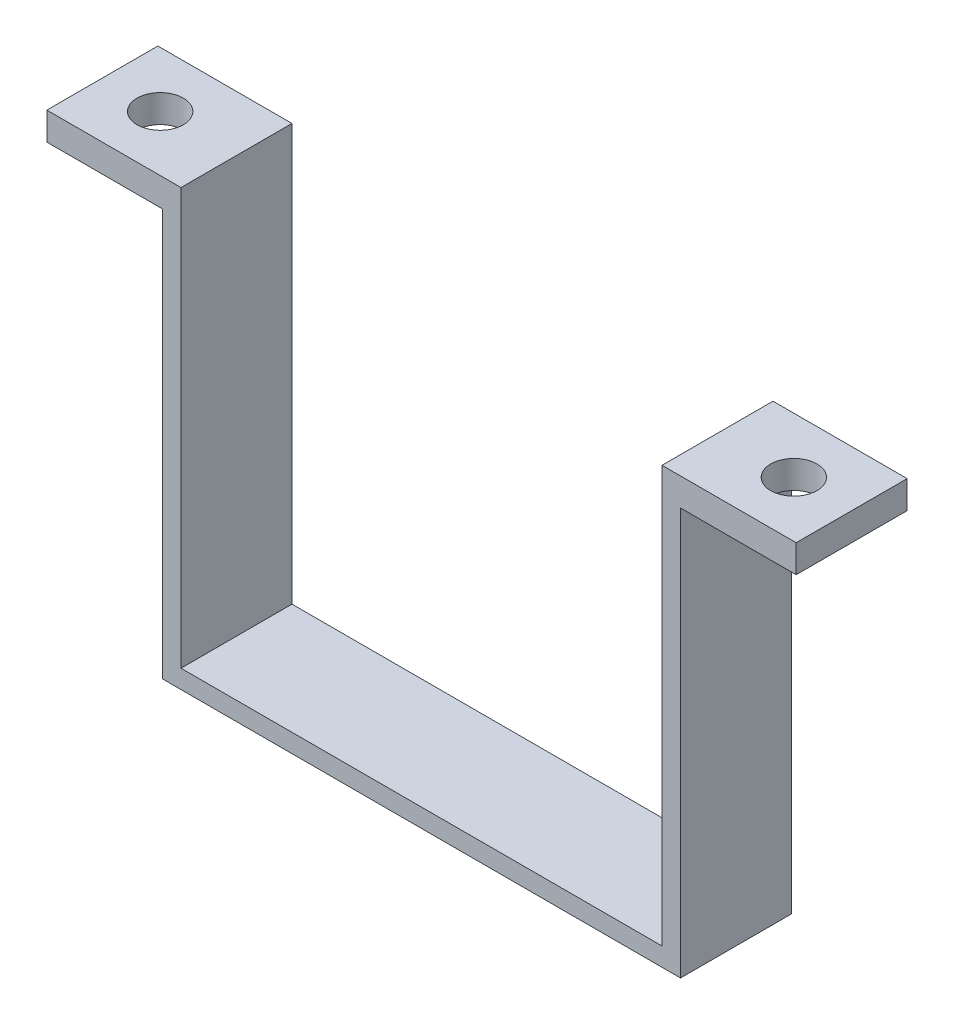
ISO-10303-21;
HEADER;
FILE_DESCRIPTION(('STEP AP214'),'2;1');
FILE_NAME('part.step','',(''),(''),'','','');
FILE_SCHEMA(('AUTOMOTIVE_DESIGN { 1 0 10303 214 1 1 1 1 }'));
ENDSEC;
DATA;
#1=APPLICATION_CONTEXT('core data for automotive mechanical design processes');
#2=APPLICATION_PROTOCOL_DEFINITION('international standard','automotive_design',2000,#1);
#3=PRODUCT_CONTEXT('',#1,'mechanical');
#4=PRODUCT('Part','Part','',(#3));
#5=PRODUCT_RELATED_PRODUCT_CATEGORY('part','',(#4));
#6=PRODUCT_DEFINITION_FORMATION('','',#4);
#7=PRODUCT_DEFINITION_CONTEXT('part definition',#1,'design');
#8=PRODUCT_DEFINITION('design','',#6,#7);
#9=PRODUCT_DEFINITION_SHAPE('','',#8);
#10=(LENGTH_UNIT() NAMED_UNIT(*) SI_UNIT(.MILLI.,.METRE.));
#11=(NAMED_UNIT(*) PLANE_ANGLE_UNIT() SI_UNIT($,.RADIAN.));
#12=(NAMED_UNIT(*) SI_UNIT($,.STERADIAN.) SOLID_ANGLE_UNIT());
#13=UNCERTAINTY_MEASURE_WITH_UNIT(LENGTH_MEASURE(1.E-05),#10,'distance_accuracy_value','');
#14=(GEOMETRIC_REPRESENTATION_CONTEXT(3) GLOBAL_UNCERTAINTY_ASSIGNED_CONTEXT((#13)) GLOBAL_UNIT_ASSIGNED_CONTEXT((#10,
#11,#12)) REPRESENTATION_CONTEXT('',''));
#15=CARTESIAN_POINT('',(0.,0.,0.));
#16=DIRECTION('',(0.,0.,1.));
#17=DIRECTION('',(1.,0.,0.));
#18=AXIS2_PLACEMENT_3D('',#15,#16,#17);
#19=CARTESIAN_POINT('',(0.,-42.,12.));
#20=DIRECTION('',(0.,-1.,0.));
#21=DIRECTION('',(1.,0.,0.));
#22=AXIS2_PLACEMENT_3D('',#19,#20,#21);
#23=PLANE('',#22);
#24=DIRECTION('',(-1.,0.,0.));
#25=VECTOR('',#24,1.);
#26=CARTESIAN_POINT('',(0.,-42.,0.));
#27=LINE('',#26,#25);
#28=CARTESIAN_POINT('',(0.,-42.,0.));
#29=VERTEX_POINT('',#28);
#30=CARTESIAN_POINT('',(-52.,-42.,0.));
#31=VERTEX_POINT('',#30);
#32=EDGE_CURVE('E144',#29,#31,#27,.T.);
#33=ORIENTED_EDGE('',*,*,#32,.T.);
#34=DIRECTION('',(0.,0.,-1.));
#35=VECTOR('',#34,1.);
#36=CARTESIAN_POINT('',(-52.,-42.,12.));
#37=LINE('',#36,#35);
#38=CARTESIAN_POINT('',(-52.,-42.,12.));
#39=VERTEX_POINT('',#38);
#40=EDGE_CURVE('E45',#39,#31,#37,.T.);
#41=ORIENTED_EDGE('',*,*,#40,.F.);
#42=DIRECTION('',(-1.,0.,0.));
#43=VECTOR('',#42,1.);
#44=CARTESIAN_POINT('',(0.,-42.,12.));
#45=LINE('',#44,#43);
#46=CARTESIAN_POINT('',(0.,-42.,12.));
#47=VERTEX_POINT('',#46);
#48=EDGE_CURVE('E99',#47,#39,#45,.T.);
#49=ORIENTED_EDGE('',*,*,#48,.F.);
#50=DIRECTION('',(0.,0.,-1.));
#51=VECTOR('',#50,1.);
#52=CARTESIAN_POINT('',(0.,-42.,12.));
#53=LINE('',#52,#51);
#54=EDGE_CURVE('E11',#47,#29,#53,.T.);
#55=ORIENTED_EDGE('',*,*,#54,.T.);
#56=EDGE_LOOP('',(#33,#41,#49,#55));
#57=FACE_BOUND('',#56,.T.);
#58=ADVANCED_FACE('F36',(#57),#23,.F.);
#59=CARTESIAN_POINT('',(-52.,-42.,12.));
#60=DIRECTION('',(-1.,0.,0.));
#61=DIRECTION('',(0.,0.,1.));
#62=AXIS2_PLACEMENT_3D('',#59,#60,#61);
#63=PLANE('',#62);
#64=DIRECTION('',(0.,1.,0.));
#65=VECTOR('',#64,1.);
#66=CARTESIAN_POINT('',(-52.,-42.,0.));
#67=LINE('',#66,#65);
#68=CARTESIAN_POINT('',(-52.,2.99999999999999,0.));
#69=VERTEX_POINT('',#68);
#70=EDGE_CURVE('E146',#31,#69,#67,.T.);
#71=ORIENTED_EDGE('',*,*,#70,.T.);
#72=DIRECTION('',(0.,0.,-1.));
#73=VECTOR('',#72,1.);
#74=CARTESIAN_POINT('',(-52.,2.99999999999999,12.));
#75=LINE('',#74,#73);
#76=CARTESIAN_POINT('',(-52.,2.99999999999999,12.));
#77=VERTEX_POINT('',#76);
#78=EDGE_CURVE('E170',#77,#69,#75,.T.);
#79=ORIENTED_EDGE('',*,*,#78,.F.);
#80=DIRECTION('',(0.,1.,0.));
#81=VECTOR('',#80,1.);
#82=CARTESIAN_POINT('',(-52.,-42.,12.));
#83=LINE('',#82,#81);
#84=EDGE_CURVE('E179',#39,#77,#83,.T.);
#85=ORIENTED_EDGE('',*,*,#84,.F.);
#86=ORIENTED_EDGE('',*,*,#40,.T.);
#87=EDGE_LOOP('',(#71,#79,#85,#86));
#88=FACE_BOUND('',#87,.T.);
#89=ADVANCED_FACE('F177',(#88),#63,.F.);
#90=CARTESIAN_POINT('',(-52.,2.99999999999999,12.));
#91=DIRECTION('',(0.,-1.,0.));
#92=DIRECTION('',(1.,0.,0.));
#93=AXIS2_PLACEMENT_3D('',#90,#91,#92);
#94=PLANE('',#93);
#95=CARTESIAN_POINT('',(-60.25,2.99999999999999,6.));
#96=DIRECTION('',(0.,-1.,0.));
#97=DIRECTION('',(1.,0.,0.));
#98=AXIS2_PLACEMENT_3D('',#95,#96,#97);
#99=CIRCLE('',#98,2.5);
#100=CARTESIAN_POINT('',(-57.75,2.99999999999999,6.));
#101=VERTEX_POINT('',#100);
#102=EDGE_CURVE('E254',#101,#101,#99,.T.);
#103=ORIENTED_EDGE('',*,*,#102,.T.);
#104=EDGE_LOOP('',(#103));
#105=FACE_BOUND('',#104,.T.);
#106=DIRECTION('',(-1.,0.,0.));
#107=VECTOR('',#106,1.);
#108=CARTESIAN_POINT('',(-52.,2.99999999999999,0.));
#109=LINE('',#108,#107);
#110=CARTESIAN_POINT('',(-66.5,2.99999999999999,0.));
#111=VERTEX_POINT('',#110);
#112=EDGE_CURVE('E149',#69,#111,#109,.T.);
#113=ORIENTED_EDGE('',*,*,#112,.T.);
#114=DIRECTION('',(0.,0.,-1.));
#115=VECTOR('',#114,1.);
#116=CARTESIAN_POINT('',(-66.5,2.99999999999999,0.));
#117=LINE('',#116,#115);
#118=CARTESIAN_POINT('',(-66.5,2.99999999999999,12.));
#119=VERTEX_POINT('',#118);
#120=EDGE_CURVE('E196',#119,#111,#117,.T.);
#121=ORIENTED_EDGE('',*,*,#120,.F.);
#122=DIRECTION('',(-1.,0.,0.));
#123=VECTOR('',#122,1.);
#124=CARTESIAN_POINT('',(-52.,2.99999999999999,12.));
#125=LINE('',#124,#123);
#126=EDGE_CURVE('E225',#77,#119,#125,.T.);
#127=ORIENTED_EDGE('',*,*,#126,.F.);
#128=ORIENTED_EDGE('',*,*,#78,.T.);
#129=EDGE_LOOP('',(#113,#121,#127,#128));
#130=FACE_BOUND('',#129,.T.);
#131=ADVANCED_FACE('F193',(#105,#130),#94,.F.);
#132=CARTESIAN_POINT('',(-64.,0.,12.));
#133=DIRECTION('',(0.,1.,0.));
#134=DIRECTION('',(0.,0.,1.));
#135=AXIS2_PLACEMENT_3D('',#132,#133,#134);
#136=PLANE('',#135);
#137=CARTESIAN_POINT('',(-60.25,0.,6.));
#138=DIRECTION('',(0.,-1.,0.));
#139=DIRECTION('',(0.,0.,-1.));
#140=AXIS2_PLACEMENT_3D('',#137,#138,#139);
#141=CIRCLE('',#140,2.5);
#142=CARTESIAN_POINT('',(-60.25,0.,3.5));
#143=VERTEX_POINT('',#142);
#144=EDGE_CURVE('E259',#143,#143,#141,.T.);
#145=ORIENTED_EDGE('',*,*,#144,.F.);
#146=EDGE_LOOP('',(#145));
#147=FACE_BOUND('',#146,.T.);
#148=DIRECTION('',(1.,0.,0.));
#149=VECTOR('',#148,1.);
#150=CARTESIAN_POINT('',(-64.,0.,0.));
#151=LINE('',#150,#149);
#152=CARTESIAN_POINT('',(-66.5,0.,0.));
#153=VERTEX_POINT('',#152);
#154=CARTESIAN_POINT('',(-54.,0.,0.));
#155=VERTEX_POINT('',#154);
#156=EDGE_CURVE('E152',#153,#155,#151,.T.);
#157=ORIENTED_EDGE('',*,*,#156,.T.);
#158=DIRECTION('',(0.,0.,-1.));
#159=VECTOR('',#158,1.);
#160=CARTESIAN_POINT('',(-54.,0.,12.));
#161=LINE('',#160,#159);
#162=CARTESIAN_POINT('',(-54.,0.,12.));
#163=VERTEX_POINT('',#162);
#164=EDGE_CURVE('E167',#163,#155,#161,.T.);
#165=ORIENTED_EDGE('',*,*,#164,.F.);
#166=DIRECTION('',(1.,0.,0.));
#167=VECTOR('',#166,1.);
#168=CARTESIAN_POINT('',(-64.,0.,12.));
#169=LINE('',#168,#167);
#170=CARTESIAN_POINT('',(-66.5,0.,12.));
#171=VERTEX_POINT('',#170);
#172=EDGE_CURVE('E228',#171,#163,#169,.T.);
#173=ORIENTED_EDGE('',*,*,#172,.F.);
#174=DIRECTION('',(0.,0.,1.));
#175=VECTOR('',#174,1.);
#176=CARTESIAN_POINT('',(-66.5,0.,0.));
#177=LINE('',#176,#175);
#178=EDGE_CURVE('E211',#153,#171,#177,.T.);
#179=ORIENTED_EDGE('',*,*,#178,.F.);
#180=EDGE_LOOP('',(#157,#165,#173,#179));
#181=FACE_BOUND('',#180,.T.);
#182=ADVANCED_FACE('F234',(#147,#181),#136,.F.);
#183=CARTESIAN_POINT('',(-54.,-44.,12.));
#184=DIRECTION('',(1.,0.,0.));
#185=DIRECTION('',(0.,0.,-1.));
#186=AXIS2_PLACEMENT_3D('',#183,#184,#185);
#187=PLANE('',#186);
#188=DIRECTION('',(0.,-1.,0.));
#189=VECTOR('',#188,1.);
#190=CARTESIAN_POINT('',(-54.,-44.,0.));
#191=LINE('',#190,#189);
#192=CARTESIAN_POINT('',(-54.,-44.,0.));
#193=VERTEX_POINT('',#192);
#194=EDGE_CURVE('E154',#155,#193,#191,.T.);
#195=ORIENTED_EDGE('',*,*,#194,.T.);
#196=DIRECTION('',(0.,0.,-1.));
#197=VECTOR('',#196,1.);
#198=CARTESIAN_POINT('',(-54.,-44.,12.));
#199=LINE('',#198,#197);
#200=CARTESIAN_POINT('',(-54.,-44.,12.));
#201=VERTEX_POINT('',#200);
#202=EDGE_CURVE('E131',#201,#193,#199,.T.);
#203=ORIENTED_EDGE('',*,*,#202,.F.);
#204=DIRECTION('',(0.,-1.,0.));
#205=VECTOR('',#204,1.);
#206=CARTESIAN_POINT('',(-54.,-44.,12.));
#207=LINE('',#206,#205);
#208=EDGE_CURVE('E122',#163,#201,#207,.T.);
#209=ORIENTED_EDGE('',*,*,#208,.F.);
#210=ORIENTED_EDGE('',*,*,#164,.T.);
#211=EDGE_LOOP('',(#195,#203,#209,#210));
#212=FACE_BOUND('',#211,.T.);
#213=ADVANCED_FACE('F237',(#212),#187,.F.);
#214=CARTESIAN_POINT('',(2.00000000000001,-44.,12.));
#215=DIRECTION('',(0.,1.,0.));
#216=DIRECTION('',(0.,0.,1.));
#217=AXIS2_PLACEMENT_3D('',#214,#215,#216);
#218=PLANE('',#217);
#219=DIRECTION('',(1.,0.,0.));
#220=VECTOR('',#219,1.);
#221=CARTESIAN_POINT('',(2.00000000000001,-44.,0.));
#222=LINE('',#221,#220);
#223=CARTESIAN_POINT('',(2.00000000000001,-44.,0.));
#224=VERTEX_POINT('',#223);
#225=EDGE_CURVE('E130',#193,#224,#222,.T.);
#226=ORIENTED_EDGE('',*,*,#225,.T.);
#227=DIRECTION('',(0.,0.,-1.));
#228=VECTOR('',#227,1.);
#229=CARTESIAN_POINT('',(2.00000000000001,-44.,12.));
#230=LINE('',#229,#228);
#231=CARTESIAN_POINT('',(2.00000000000001,-44.,12.));
#232=VERTEX_POINT('',#231);
#233=EDGE_CURVE('E127',#232,#224,#230,.T.);
#234=ORIENTED_EDGE('',*,*,#233,.F.);
#235=DIRECTION('',(1.,0.,0.));
#236=VECTOR('',#235,1.);
#237=CARTESIAN_POINT('',(2.00000000000001,-44.,12.));
#238=LINE('',#237,#236);
#239=EDGE_CURVE('E115',#201,#232,#238,.T.);
#240=ORIENTED_EDGE('',*,*,#239,.F.);
#241=ORIENTED_EDGE('',*,*,#202,.T.);
#242=EDGE_LOOP('',(#226,#234,#240,#241));
#243=FACE_BOUND('',#242,.T.);
#244=ADVANCED_FACE('F128',(#243),#218,.F.);
#245=CARTESIAN_POINT('',(2.,0.,12.));
#246=DIRECTION('',(-1.,0.,0.));
#247=DIRECTION('',(0.,-1.,0.));
#248=AXIS2_PLACEMENT_3D('',#245,#246,#247);
#249=PLANE('',#248);
#250=DIRECTION('',(0.,1.,0.));
#251=VECTOR('',#250,1.);
#252=CARTESIAN_POINT('',(2.,0.,0.));
#253=LINE('',#252,#251);
#254=CARTESIAN_POINT('',(2.,0.,0.));
#255=VERTEX_POINT('',#254);
#256=EDGE_CURVE('E84',#224,#255,#253,.T.);
#257=ORIENTED_EDGE('',*,*,#256,.T.);
#258=DIRECTION('',(0.,0.,-1.));
#259=VECTOR('',#258,1.);
#260=CARTESIAN_POINT('',(2.,0.,12.));
#261=LINE('',#260,#259);
#262=CARTESIAN_POINT('',(2.,0.,12.));
#263=VERTEX_POINT('',#262);
#264=EDGE_CURVE('E132',#263,#255,#261,.T.);
#265=ORIENTED_EDGE('',*,*,#264,.F.);
#266=DIRECTION('',(0.,1.,0.));
#267=VECTOR('',#266,1.);
#268=CARTESIAN_POINT('',(2.,0.,12.));
#269=LINE('',#268,#267);
#270=EDGE_CURVE('E120',#232,#263,#269,.T.);
#271=ORIENTED_EDGE('',*,*,#270,.F.);
#272=ORIENTED_EDGE('',*,*,#233,.T.);
#273=EDGE_LOOP('',(#257,#265,#271,#272));
#274=FACE_BOUND('',#273,.T.);
#275=ADVANCED_FACE('F134',(#274),#249,.F.);
#276=CARTESIAN_POINT('',(12.,0.,12.));
#277=DIRECTION('',(0.,1.,0.));
#278=DIRECTION('',(-1.,0.,0.));
#279=AXIS2_PLACEMENT_3D('',#276,#277,#278);
#280=PLANE('',#279);
#281=CARTESIAN_POINT('',(8.25,0.,6.));
#282=DIRECTION('',(0.,-1.,0.));
#283=DIRECTION('',(1.,0.,0.));
#284=AXIS2_PLACEMENT_3D('',#281,#282,#283);
#285=CIRCLE('',#284,2.5);
#286=CARTESIAN_POINT('',(10.75,0.,6.));
#287=VERTEX_POINT('',#286);
#288=EDGE_CURVE('E262',#287,#287,#285,.T.);
#289=ORIENTED_EDGE('',*,*,#288,.F.);
#290=EDGE_LOOP('',(#289));
#291=FACE_BOUND('',#290,.T.);
#292=DIRECTION('',(1.,0.,0.));
#293=VECTOR('',#292,1.);
#294=CARTESIAN_POINT('',(12.,0.,0.));
#295=LINE('',#294,#293);
#296=CARTESIAN_POINT('',(14.5,0.,0.));
#297=VERTEX_POINT('',#296);
#298=EDGE_CURVE('E158',#255,#297,#295,.T.);
#299=ORIENTED_EDGE('',*,*,#298,.T.);
#300=DIRECTION('',(0.,0.,-1.));
#301=VECTOR('',#300,1.);
#302=CARTESIAN_POINT('',(14.5,0.,12.));
#303=LINE('',#302,#301);
#304=CARTESIAN_POINT('',(14.5,0.,12.));
#305=VERTEX_POINT('',#304);
#306=EDGE_CURVE('E209',#305,#297,#303,.T.);
#307=ORIENTED_EDGE('',*,*,#306,.F.);
#308=DIRECTION('',(1.,0.,0.));
#309=VECTOR('',#308,1.);
#310=CARTESIAN_POINT('',(12.,0.,12.));
#311=LINE('',#310,#309);
#312=EDGE_CURVE('E136',#263,#305,#311,.T.);
#313=ORIENTED_EDGE('',*,*,#312,.F.);
#314=ORIENTED_EDGE('',*,*,#264,.T.);
#315=EDGE_LOOP('',(#299,#307,#313,#314));
#316=FACE_BOUND('',#315,.T.);
#317=ADVANCED_FACE('F243',(#291,#316),#280,.F.);
#318=CARTESIAN_POINT('',(0.,3.,12.));
#319=DIRECTION('',(0.,-1.,0.));
#320=DIRECTION('',(0.,0.,-1.));
#321=AXIS2_PLACEMENT_3D('',#318,#319,#320);
#322=PLANE('',#321);
#323=CARTESIAN_POINT('',(8.25,3.,6.));
#324=DIRECTION('',(0.,-1.,0.));
#325=DIRECTION('',(0.,0.,-1.));
#326=AXIS2_PLACEMENT_3D('',#323,#324,#325);
#327=CIRCLE('',#326,2.5);
#328=CARTESIAN_POINT('',(8.25,3.,3.5));
#329=VERTEX_POINT('',#328);
#330=EDGE_CURVE('E39',#329,#329,#327,.T.);
#331=ORIENTED_EDGE('',*,*,#330,.T.);
#332=EDGE_LOOP('',(#331));
#333=FACE_BOUND('',#332,.T.);
#334=DIRECTION('',(-1.,0.,0.));
#335=VECTOR('',#334,1.);
#336=CARTESIAN_POINT('',(0.,3.,0.));
#337=LINE('',#336,#335);
#338=CARTESIAN_POINT('',(14.5,3.,0.));
#339=VERTEX_POINT('',#338);
#340=CARTESIAN_POINT('',(0.,3.,0.));
#341=VERTEX_POINT('',#340);
#342=EDGE_CURVE('E92',#339,#341,#337,.T.);
#343=ORIENTED_EDGE('',*,*,#342,.T.);
#344=DIRECTION('',(0.,0.,-1.));
#345=VECTOR('',#344,1.);
#346=CARTESIAN_POINT('',(0.,3.,12.));
#347=LINE('',#346,#345);
#348=CARTESIAN_POINT('',(0.,3.,12.));
#349=VERTEX_POINT('',#348);
#350=EDGE_CURVE('E143',#349,#341,#347,.T.);
#351=ORIENTED_EDGE('',*,*,#350,.F.);
#352=DIRECTION('',(-1.,0.,0.));
#353=VECTOR('',#352,1.);
#354=CARTESIAN_POINT('',(0.,3.,12.));
#355=LINE('',#354,#353);
#356=CARTESIAN_POINT('',(14.5,3.,12.));
#357=VERTEX_POINT('',#356);
#358=EDGE_CURVE('E138',#357,#349,#355,.T.);
#359=ORIENTED_EDGE('',*,*,#358,.F.);
#360=DIRECTION('',(0.,0.,1.));
#361=VECTOR('',#360,1.);
#362=CARTESIAN_POINT('',(14.5,3.,12.));
#363=LINE('',#362,#361);
#364=EDGE_CURVE('E147',#339,#357,#363,.T.);
#365=ORIENTED_EDGE('',*,*,#364,.F.);
#366=EDGE_LOOP('',(#343,#351,#359,#365));
#367=FACE_BOUND('',#366,.T.);
#368=ADVANCED_FACE('F269',(#333,#367),#322,.F.);
#369=CARTESIAN_POINT('',(0.,0.,12.));
#370=DIRECTION('',(1.,0.,0.));
#371=DIRECTION('',(0.,0.,-1.));
#372=AXIS2_PLACEMENT_3D('',#369,#370,#371);
#373=PLANE('',#372);
#374=DIRECTION('',(0.,-1.,0.));
#375=VECTOR('',#374,1.);
#376=CARTESIAN_POINT('',(0.,0.,0.));
#377=LINE('',#376,#375);
#378=EDGE_CURVE('E162',#341,#29,#377,.T.);
#379=ORIENTED_EDGE('',*,*,#378,.T.);
#380=ORIENTED_EDGE('',*,*,#54,.F.);
#381=DIRECTION('',(0.,-1.,0.));
#382=VECTOR('',#381,1.);
#383=CARTESIAN_POINT('',(0.,0.,12.));
#384=LINE('',#383,#382);
#385=EDGE_CURVE('E53',#349,#47,#384,.T.);
#386=ORIENTED_EDGE('',*,*,#385,.F.);
#387=ORIENTED_EDGE('',*,*,#350,.T.);
#388=EDGE_LOOP('',(#379,#380,#386,#387));
#389=FACE_BOUND('',#388,.T.);
#390=ADVANCED_FACE('F284',(#389),#373,.F.);
#391=CARTESIAN_POINT('',(0.,0.,12.));
#392=DIRECTION('',(0.,0.,-1.));
#393=DIRECTION('',(-1.,0.,0.));
#394=AXIS2_PLACEMENT_3D('',#391,#392,#393);
#395=PLANE('',#394);
#396=ORIENTED_EDGE('',*,*,#385,.T.);
#397=ORIENTED_EDGE('',*,*,#48,.T.);
#398=ORIENTED_EDGE('',*,*,#84,.T.);
#399=ORIENTED_EDGE('',*,*,#126,.T.);
#400=DIRECTION('',(0.,1.,0.));
#401=VECTOR('',#400,1.);
#402=CARTESIAN_POINT('',(-66.5,0.,12.));
#403=LINE('',#402,#401);
#404=EDGE_CURVE('E205',#171,#119,#403,.T.);
#405=ORIENTED_EDGE('',*,*,#404,.F.);
#406=ORIENTED_EDGE('',*,*,#172,.T.);
#407=ORIENTED_EDGE('',*,*,#208,.T.);
#408=ORIENTED_EDGE('',*,*,#239,.T.);
#409=ORIENTED_EDGE('',*,*,#270,.T.);
#410=ORIENTED_EDGE('',*,*,#312,.T.);
#411=DIRECTION('',(0.,-1.,0.));
#412=VECTOR('',#411,1.);
#413=CARTESIAN_POINT('',(14.5,0.,12.));
#414=LINE('',#413,#412);
#415=EDGE_CURVE('E206',#357,#305,#414,.T.);
#416=ORIENTED_EDGE('',*,*,#415,.F.);
#417=ORIENTED_EDGE('',*,*,#358,.T.);
#418=EDGE_LOOP('',(#396,#397,#398,#399,#405,#406,#407,#408,#409,#410,#416,#417));
#419=FACE_BOUND('',#418,.T.);
#420=ADVANCED_FACE('F117',(#419),#395,.F.);
#421=CARTESIAN_POINT('',(0.,0.,0.));
#422=DIRECTION('',(0.,0.,-1.));
#423=DIRECTION('',(-1.,0.,0.));
#424=AXIS2_PLACEMENT_3D('',#421,#422,#423);
#425=PLANE('',#424);
#426=ORIENTED_EDGE('',*,*,#32,.F.);
#427=ORIENTED_EDGE('',*,*,#378,.F.);
#428=ORIENTED_EDGE('',*,*,#342,.F.);
#429=DIRECTION('',(0.,1.,0.));
#430=VECTOR('',#429,1.);
#431=CARTESIAN_POINT('',(14.5,0.,0.));
#432=LINE('',#431,#430);
#433=EDGE_CURVE('E217',#297,#339,#432,.T.);
#434=ORIENTED_EDGE('',*,*,#433,.F.);
#435=ORIENTED_EDGE('',*,*,#298,.F.);
#436=ORIENTED_EDGE('',*,*,#256,.F.);
#437=ORIENTED_EDGE('',*,*,#225,.F.);
#438=ORIENTED_EDGE('',*,*,#194,.F.);
#439=ORIENTED_EDGE('',*,*,#156,.F.);
#440=DIRECTION('',(0.,-1.,0.));
#441=VECTOR('',#440,1.);
#442=CARTESIAN_POINT('',(-66.5,0.,0.));
#443=LINE('',#442,#441);
#444=EDGE_CURVE('E189',#111,#153,#443,.T.);
#445=ORIENTED_EDGE('',*,*,#444,.F.);
#446=ORIENTED_EDGE('',*,*,#112,.F.);
#447=ORIENTED_EDGE('',*,*,#70,.F.);
#448=EDGE_LOOP('',(#426,#427,#428,#434,#435,#436,#437,#438,#439,#445,#446,#447));
#449=FACE_BOUND('',#448,.T.);
#450=ADVANCED_FACE('F183',(#449),#425,.T.);
#451=CARTESIAN_POINT('',(14.5,0.,0.));
#452=DIRECTION('',(-1.,0.,0.));
#453=DIRECTION('',(0.,0.,1.));
#454=AXIS2_PLACEMENT_3D('',#451,#452,#453);
#455=PLANE('',#454);
#456=ORIENTED_EDGE('',*,*,#415,.T.);
#457=ORIENTED_EDGE('',*,*,#306,.T.);
#458=ORIENTED_EDGE('',*,*,#433,.T.);
#459=ORIENTED_EDGE('',*,*,#364,.T.);
#460=EDGE_LOOP('',(#456,#457,#458,#459));
#461=FACE_BOUND('',#460,.T.);
#462=ADVANCED_FACE('F247',(#461),#455,.F.);
#463=CARTESIAN_POINT('',(-66.5,0.,0.));
#464=DIRECTION('',(1.,0.,0.));
#465=DIRECTION('',(0.,0.,-1.));
#466=AXIS2_PLACEMENT_3D('',#463,#464,#465);
#467=PLANE('',#466);
#468=ORIENTED_EDGE('',*,*,#444,.T.);
#469=ORIENTED_EDGE('',*,*,#178,.T.);
#470=ORIENTED_EDGE('',*,*,#404,.T.);
#471=ORIENTED_EDGE('',*,*,#120,.T.);
#472=EDGE_LOOP('',(#468,#469,#470,#471));
#473=FACE_BOUND('',#472,.T.);
#474=ADVANCED_FACE('F201',(#473),#467,.F.);
#475=CARTESIAN_POINT('',(-60.25,10.,6.));
#476=DIRECTION('',(0.,-1.,0.));
#477=DIRECTION('',(0.,0.,-1.));
#478=AXIS2_PLACEMENT_3D('',#475,#476,#477);
#479=CYLINDRICAL_SURFACE('',#478,2.5);
#480=ORIENTED_EDGE('',*,*,#144,.T.);
#481=EDGE_LOOP('',(#480));
#482=FACE_BOUND('',#481,.T.);
#483=ORIENTED_EDGE('',*,*,#102,.F.);
#484=EDGE_LOOP('',(#483));
#485=FACE_BOUND('',#484,.T.);
#486=ADVANCED_FACE('F273',(#482,#485),#479,.F.);
#487=CARTESIAN_POINT('',(8.25,10.,6.));
#488=DIRECTION('',(0.,-1.,0.));
#489=DIRECTION('',(1.,0.,0.));
#490=AXIS2_PLACEMENT_3D('',#487,#488,#489);
#491=CYLINDRICAL_SURFACE('',#490,2.5);
#492=ORIENTED_EDGE('',*,*,#288,.T.);
#493=EDGE_LOOP('',(#492));
#494=FACE_BOUND('',#493,.T.);
#495=ORIENTED_EDGE('',*,*,#330,.F.);
#496=EDGE_LOOP('',(#495));
#497=FACE_BOUND('',#496,.T.);
#498=ADVANCED_FACE('F271',(#494,#497),#491,.F.);
#499=CLOSED_SHELL('',(#58,#89,#131,#182,#213,#244,#275,#317,#368,#390,#420,#450,#462,#474,#486,#498));
#500=MANIFOLD_SOLID_BREP('B2',#499);
#501=ADVANCED_BREP_SHAPE_REPRESENTATION('',(#18,#500),#14);
#502=SHAPE_DEFINITION_REPRESENTATION(#9,#501);
ENDSEC;
END-ISO-10303-21;
